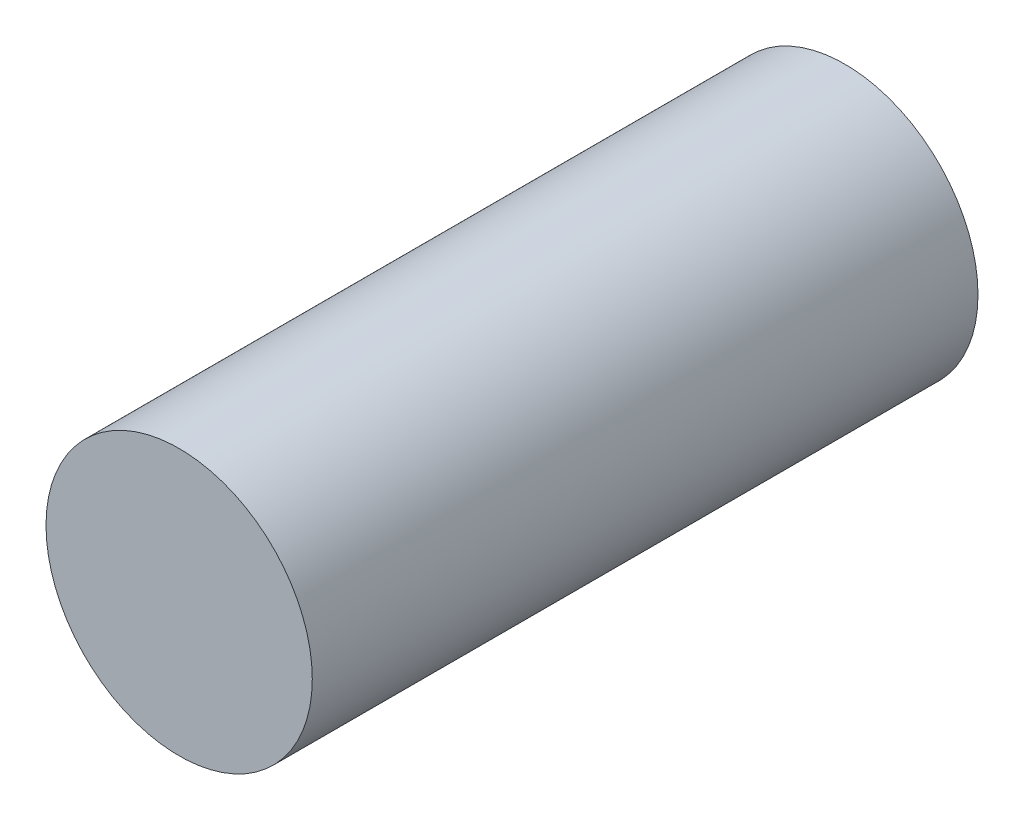
ISO-10303-21;
HEADER;
FILE_DESCRIPTION(('STEP AP214'),'2;1');
FILE_NAME('part.step','',(''),(''),'','','');
FILE_SCHEMA(('AUTOMOTIVE_DESIGN { 1 0 10303 214 1 1 1 1 }'));
ENDSEC;
DATA;
#1=APPLICATION_CONTEXT('core data for automotive mechanical design processes');
#2=APPLICATION_PROTOCOL_DEFINITION('international standard','automotive_design',2000,#1);
#3=PRODUCT_CONTEXT('',#1,'mechanical');
#4=PRODUCT('Part','Part','',(#3));
#5=PRODUCT_RELATED_PRODUCT_CATEGORY('part','',(#4));
#6=PRODUCT_DEFINITION_FORMATION('','',#4);
#7=PRODUCT_DEFINITION_CONTEXT('part definition',#1,'design');
#8=PRODUCT_DEFINITION('design','',#6,#7);
#9=PRODUCT_DEFINITION_SHAPE('','',#8);
#10=(LENGTH_UNIT() NAMED_UNIT(*) SI_UNIT(.MILLI.,.METRE.));
#11=(NAMED_UNIT(*) PLANE_ANGLE_UNIT() SI_UNIT($,.RADIAN.));
#12=(NAMED_UNIT(*) SI_UNIT($,.STERADIAN.) SOLID_ANGLE_UNIT());
#13=UNCERTAINTY_MEASURE_WITH_UNIT(LENGTH_MEASURE(1.E-05),#10,'distance_accuracy_value','');
#14=(GEOMETRIC_REPRESENTATION_CONTEXT(3) GLOBAL_UNCERTAINTY_ASSIGNED_CONTEXT((#13)) GLOBAL_UNIT_ASSIGNED_CONTEXT((#10,
#11,#12)) REPRESENTATION_CONTEXT('',''));
#15=CARTESIAN_POINT('',(0.,0.,0.));
#16=DIRECTION('',(0.,0.,1.));
#17=DIRECTION('',(1.,0.,0.));
#18=AXIS2_PLACEMENT_3D('',#15,#16,#17);
#19=CARTESIAN_POINT('',(0.,0.,5.));
#20=DIRECTION('',(0.,0.,1.));
#21=DIRECTION('',(1.,0.,0.));
#22=AXIS2_PLACEMENT_3D('',#19,#20,#21);
#23=PLANE('',#22);
#24=CARTESIAN_POINT('',(0.,0.,5.));
#25=DIRECTION('',(0.,0.,-1.));
#26=DIRECTION('',(-1.,0.,0.));
#27=AXIS2_PLACEMENT_3D('',#24,#25,#26);
#28=CIRCLE('',#27,1.);
#29=CARTESIAN_POINT('',(-1.,0.,5.));
#30=VERTEX_POINT('',#29);
#31=EDGE_CURVE('E18',#30,#30,#28,.T.);
#32=ORIENTED_EDGE('',*,*,#31,.F.);
#33=EDGE_LOOP('',(#32));
#34=FACE_BOUND('',#33,.T.);
#35=ADVANCED_FACE('F15',(#34),#23,.T.);
#36=CARTESIAN_POINT('',(0.,0.,0.));
#37=DIRECTION('',(0.,0.,1.));
#38=DIRECTION('',(1.,0.,0.));
#39=AXIS2_PLACEMENT_3D('',#36,#37,#38);
#40=PLANE('',#39);
#41=CARTESIAN_POINT('',(0.,0.,0.));
#42=DIRECTION('',(0.,0.,-1.));
#43=DIRECTION('',(-1.,0.,0.));
#44=AXIS2_PLACEMENT_3D('',#41,#42,#43);
#45=CIRCLE('',#44,1.);
#46=CARTESIAN_POINT('',(-1.,0.,0.));
#47=VERTEX_POINT('',#46);
#48=EDGE_CURVE('E10',#47,#47,#45,.F.);
#49=ORIENTED_EDGE('',*,*,#48,.F.);
#50=EDGE_LOOP('',(#49));
#51=FACE_BOUND('',#50,.T.);
#52=ADVANCED_FACE('F30',(#51),#40,.F.);
#53=CARTESIAN_POINT('',(0.,0.,5.));
#54=DIRECTION('',(0.,0.,-1.));
#55=DIRECTION('',(-1.,0.,0.));
#56=AXIS2_PLACEMENT_3D('',#53,#54,#55);
#57=CYLINDRICAL_SURFACE('',#56,1.);
#58=ORIENTED_EDGE('',*,*,#48,.T.);
#59=EDGE_LOOP('',(#58));
#60=FACE_BOUND('',#59,.T.);
#61=ORIENTED_EDGE('',*,*,#31,.T.);
#62=EDGE_LOOP('',(#61));
#63=FACE_BOUND('',#62,.T.);
#64=ADVANCED_FACE('F27',(#60,#63),#57,.T.);
#65=CLOSED_SHELL('',(#35,#52,#64));
#66=MANIFOLD_SOLID_BREP('B1',#65);
#67=ADVANCED_BREP_SHAPE_REPRESENTATION('',(#18,#66),#14);
#68=SHAPE_DEFINITION_REPRESENTATION(#9,#67);
ENDSEC;
END-ISO-10303-21;
